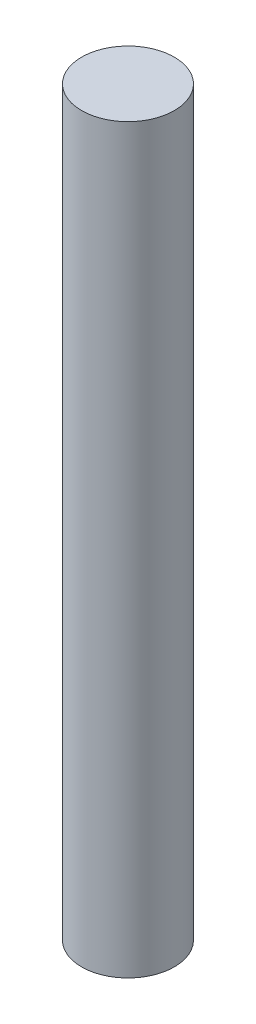
ISO-10303-21;
HEADER;
FILE_DESCRIPTION(('STEP AP214'),'2;1');
FILE_NAME('part.step','',(''),(''),'','','');
FILE_SCHEMA(('AUTOMOTIVE_DESIGN { 1 0 10303 214 1 1 1 1 }'));
ENDSEC;
DATA;
#1=APPLICATION_CONTEXT('core data for automotive mechanical design processes');
#2=APPLICATION_PROTOCOL_DEFINITION('international standard','automotive_design',2000,#1);
#3=PRODUCT_CONTEXT('',#1,'mechanical');
#4=PRODUCT('Part','Part','',(#3));
#5=PRODUCT_RELATED_PRODUCT_CATEGORY('part','',(#4));
#6=PRODUCT_DEFINITION_FORMATION('','',#4);
#7=PRODUCT_DEFINITION_CONTEXT('part definition',#1,'design');
#8=PRODUCT_DEFINITION('design','',#6,#7);
#9=PRODUCT_DEFINITION_SHAPE('','',#8);
#10=(LENGTH_UNIT() NAMED_UNIT(*) SI_UNIT(.MILLI.,.METRE.));
#11=(NAMED_UNIT(*) PLANE_ANGLE_UNIT() SI_UNIT($,.RADIAN.));
#12=(NAMED_UNIT(*) SI_UNIT($,.STERADIAN.) SOLID_ANGLE_UNIT());
#13=UNCERTAINTY_MEASURE_WITH_UNIT(LENGTH_MEASURE(1.E-05),#10,'distance_accuracy_value','');
#14=(GEOMETRIC_REPRESENTATION_CONTEXT(3) GLOBAL_UNCERTAINTY_ASSIGNED_CONTEXT((#13)) GLOBAL_UNIT_ASSIGNED_CONTEXT((#10,
#11,#12)) REPRESENTATION_CONTEXT('',''));
#15=CARTESIAN_POINT('',(0.,0.,0.));
#16=DIRECTION('',(0.,0.,1.));
#17=DIRECTION('',(1.,0.,0.));
#18=AXIS2_PLACEMENT_3D('',#15,#16,#17);
#19=CARTESIAN_POINT('',(0.,20.,0.));
#20=DIRECTION('',(0.,-1.,0.));
#21=DIRECTION('',(0.,0.,-1.));
#22=AXIS2_PLACEMENT_3D('',#19,#20,#21);
#23=CYLINDRICAL_SURFACE('',#22,2.5);
#24=CARTESIAN_POINT('',(0.,20.,0.));
#25=DIRECTION('',(0.,1.,0.));
#26=DIRECTION('',(0.,0.,1.));
#27=AXIS2_PLACEMENT_3D('',#24,#25,#26);
#28=CIRCLE('',#27,2.5);
#29=CARTESIAN_POINT('',(0.,20.,2.5));
#30=VERTEX_POINT('',#29);
#31=EDGE_CURVE('E10',#30,#30,#28,.T.);
#32=ORIENTED_EDGE('',*,*,#31,.F.);
#33=EDGE_LOOP('',(#32));
#34=FACE_BOUND('',#33,.T.);
#35=CARTESIAN_POINT('',(0.,-20.,0.));
#36=DIRECTION('',(0.,1.,0.));
#37=DIRECTION('',(0.,0.,1.));
#38=AXIS2_PLACEMENT_3D('',#35,#36,#37);
#39=CIRCLE('',#38,2.5);
#40=CARTESIAN_POINT('',(0.,-20.,2.5));
#41=VERTEX_POINT('',#40);
#42=EDGE_CURVE('E34',#41,#41,#39,.T.);
#43=ORIENTED_EDGE('',*,*,#42,.T.);
#44=EDGE_LOOP('',(#43));
#45=FACE_BOUND('',#44,.T.);
#46=ADVANCED_FACE('F31',(#34,#45),#23,.T.);
#47=CARTESIAN_POINT('',(0.,20.,0.));
#48=DIRECTION('',(0.,1.,0.));
#49=DIRECTION('',(0.,0.,1.));
#50=AXIS2_PLACEMENT_3D('',#47,#48,#49);
#51=PLANE('',#50);
#52=ORIENTED_EDGE('',*,*,#31,.T.);
#53=EDGE_LOOP('',(#52));
#54=FACE_BOUND('',#53,.T.);
#55=ADVANCED_FACE('F46',(#54),#51,.T.);
#56=CARTESIAN_POINT('',(0.,-20.,0.));
#57=DIRECTION('',(0.,1.,0.));
#58=DIRECTION('',(0.,0.,1.));
#59=AXIS2_PLACEMENT_3D('',#56,#57,#58);
#60=PLANE('',#59);
#61=ORIENTED_EDGE('',*,*,#42,.F.);
#62=EDGE_LOOP('',(#61));
#63=FACE_BOUND('',#62,.T.);
#64=ADVANCED_FACE('F44',(#63),#60,.F.);
#65=CLOSED_SHELL('',(#46,#55,#64));
#66=MANIFOLD_SOLID_BREP('B2',#65);
#67=ADVANCED_BREP_SHAPE_REPRESENTATION('',(#18,#66),#14);
#68=SHAPE_DEFINITION_REPRESENTATION(#9,#67);
ENDSEC;
END-ISO-10303-21;
